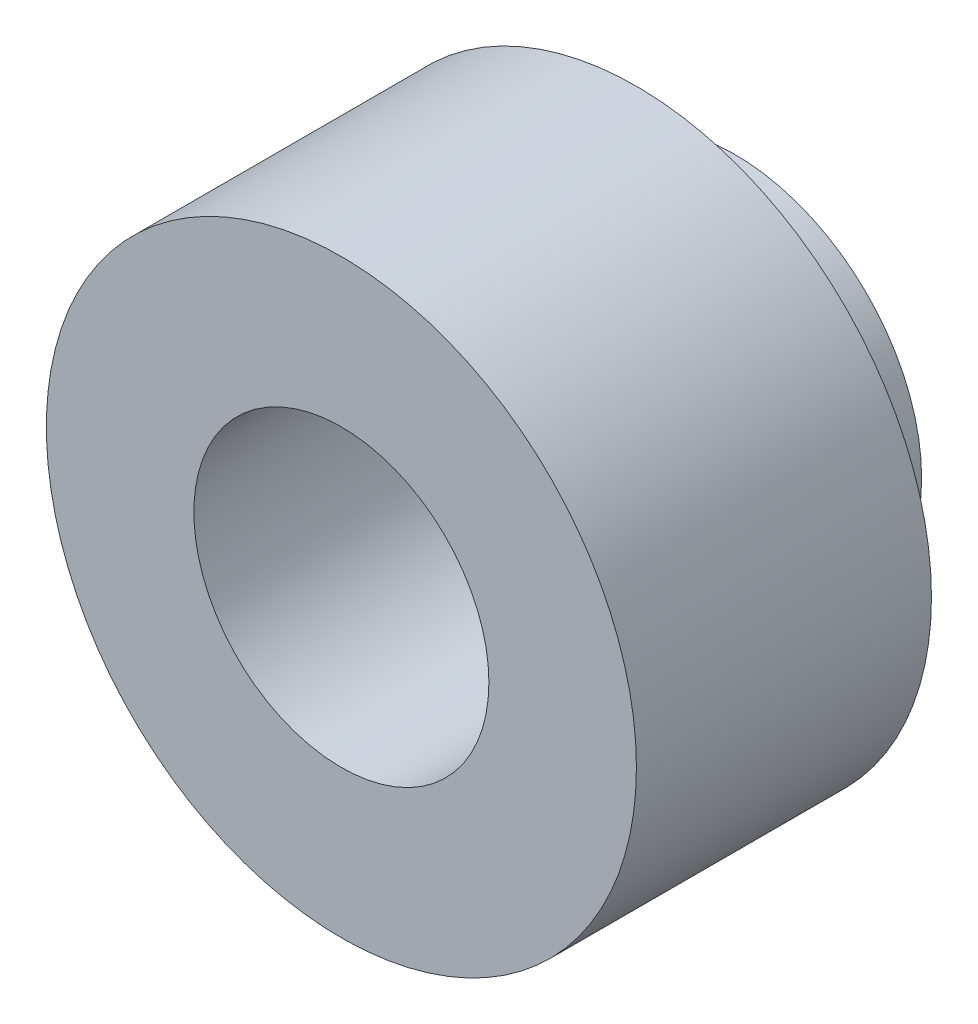
ISO-10303-21;
HEADER;
FILE_DESCRIPTION(('STEP AP214'),'2;1');
FILE_NAME('part.step','',(''),(''),'','','');
FILE_SCHEMA(('AUTOMOTIVE_DESIGN { 1 0 10303 214 1 1 1 1 }'));
ENDSEC;
DATA;
#1=APPLICATION_CONTEXT('core data for automotive mechanical design processes');
#2=APPLICATION_PROTOCOL_DEFINITION('international standard','automotive_design',2000,#1);
#3=PRODUCT_CONTEXT('',#1,'mechanical');
#4=PRODUCT('Part','Part','',(#3));
#5=PRODUCT_RELATED_PRODUCT_CATEGORY('part','',(#4));
#6=PRODUCT_DEFINITION_FORMATION('','',#4);
#7=PRODUCT_DEFINITION_CONTEXT('part definition',#1,'design');
#8=PRODUCT_DEFINITION('design','',#6,#7);
#9=PRODUCT_DEFINITION_SHAPE('','',#8);
#10=(LENGTH_UNIT() NAMED_UNIT(*) SI_UNIT(.MILLI.,.METRE.));
#11=(NAMED_UNIT(*) PLANE_ANGLE_UNIT() SI_UNIT($,.RADIAN.));
#12=(NAMED_UNIT(*) SI_UNIT($,.STERADIAN.) SOLID_ANGLE_UNIT());
#13=UNCERTAINTY_MEASURE_WITH_UNIT(LENGTH_MEASURE(1.E-05),#10,'distance_accuracy_value','');
#14=(GEOMETRIC_REPRESENTATION_CONTEXT(3) GLOBAL_UNCERTAINTY_ASSIGNED_CONTEXT((#13)) GLOBAL_UNIT_ASSIGNED_CONTEXT((#10,
#11,#12)) REPRESENTATION_CONTEXT('',''));
#15=CARTESIAN_POINT('',(0.,0.,0.));
#16=DIRECTION('',(0.,0.,1.));
#17=DIRECTION('',(1.,0.,0.));
#18=AXIS2_PLACEMENT_3D('',#15,#16,#17);
#19=CARTESIAN_POINT('',(0.,0.,0.));
#20=DIRECTION('',(0.,0.,1.));
#21=DIRECTION('',(1.,0.,0.));
#22=AXIS2_PLACEMENT_3D('',#19,#20,#21);
#23=CYLINDRICAL_SURFACE('',#22,1.875);
#24=CARTESIAN_POINT('',(0.,0.,0.));
#25=DIRECTION('',(0.,0.,1.));
#26=DIRECTION('',(1.,0.,0.));
#27=AXIS2_PLACEMENT_3D('',#24,#25,#26);
#28=CIRCLE('',#27,1.875);
#29=CARTESIAN_POINT('',(1.875,0.,0.));
#30=VERTEX_POINT('',#29);
#31=EDGE_CURVE('E53',#30,#30,#28,.T.);
#32=ORIENTED_EDGE('',*,*,#31,.T.);
#33=EDGE_LOOP('',(#32));
#34=FACE_BOUND('',#33,.T.);
#35=CARTESIAN_POINT('',(0.,0.,-5.));
#36=DIRECTION('',(0.,0.,1.));
#37=DIRECTION('',(1.,0.,0.));
#38=AXIS2_PLACEMENT_3D('',#35,#36,#37);
#39=CIRCLE('',#38,1.875);
#40=CARTESIAN_POINT('',(1.875,0.,-5.));
#41=VERTEX_POINT('',#40);
#42=EDGE_CURVE('E10',#41,#41,#39,.T.);
#43=ORIENTED_EDGE('',*,*,#42,.F.);
#44=EDGE_LOOP('',(#43));
#45=FACE_BOUND('',#44,.T.);
#46=ADVANCED_FACE('F31',(#34,#45),#23,.F.);
#47=CARTESIAN_POINT('',(1.875,0.,-5.));
#48=DIRECTION('',(0.,0.,-1.));
#49=DIRECTION('',(-1.,0.,0.));
#50=AXIS2_PLACEMENT_3D('',#47,#48,#49);
#51=PLANE('',#50);
#52=ORIENTED_EDGE('',*,*,#42,.T.);
#53=EDGE_LOOP('',(#52));
#54=FACE_BOUND('',#53,.T.);
#55=CARTESIAN_POINT('',(0.,0.,-5.));
#56=DIRECTION('',(0.,0.,1.));
#57=DIRECTION('',(1.,0.,0.));
#58=AXIS2_PLACEMENT_3D('',#55,#56,#57);
#59=CIRCLE('',#58,2.375);
#60=CARTESIAN_POINT('',(2.375,0.,-5.));
#61=VERTEX_POINT('',#60);
#62=EDGE_CURVE('E37',#61,#61,#59,.T.);
#63=ORIENTED_EDGE('',*,*,#62,.F.);
#64=EDGE_LOOP('',(#63));
#65=FACE_BOUND('',#64,.T.);
#66=ADVANCED_FACE('F71',(#54,#65),#51,.T.);
#67=CARTESIAN_POINT('',(0.,0.,0.));
#68=DIRECTION('',(0.,0.,1.));
#69=DIRECTION('',(1.,0.,0.));
#70=AXIS2_PLACEMENT_3D('',#67,#68,#69);
#71=CYLINDRICAL_SURFACE('',#70,2.375);
#72=ORIENTED_EDGE('',*,*,#62,.T.);
#73=EDGE_LOOP('',(#72));
#74=FACE_BOUND('',#73,.T.);
#75=CARTESIAN_POINT('',(0.,0.,-3.75));
#76=DIRECTION('',(0.,0.,1.));
#77=DIRECTION('',(1.,0.,0.));
#78=AXIS2_PLACEMENT_3D('',#75,#76,#77);
#79=CIRCLE('',#78,2.375);
#80=CARTESIAN_POINT('',(2.375,0.,-3.75));
#81=VERTEX_POINT('',#80);
#82=EDGE_CURVE('E41',#81,#81,#79,.T.);
#83=ORIENTED_EDGE('',*,*,#82,.F.);
#84=EDGE_LOOP('',(#83));
#85=FACE_BOUND('',#84,.T.);
#86=ADVANCED_FACE('F75',(#74,#85),#71,.T.);
#87=CARTESIAN_POINT('',(2.375,0.,-3.75));
#88=DIRECTION('',(0.,0.,-1.));
#89=DIRECTION('',(-1.,0.,0.));
#90=AXIS2_PLACEMENT_3D('',#87,#88,#89);
#91=PLANE('',#90);
#92=ORIENTED_EDGE('',*,*,#82,.T.);
#93=EDGE_LOOP('',(#92));
#94=FACE_BOUND('',#93,.T.);
#95=CARTESIAN_POINT('',(0.,0.,-3.75));
#96=DIRECTION('',(0.,0.,1.));
#97=DIRECTION('',(1.,0.,0.));
#98=AXIS2_PLACEMENT_3D('',#95,#96,#97);
#99=CIRCLE('',#98,3.75);
#100=CARTESIAN_POINT('',(3.75,0.,-3.75));
#101=VERTEX_POINT('',#100);
#102=EDGE_CURVE('E45',#101,#101,#99,.T.);
#103=ORIENTED_EDGE('',*,*,#102,.F.);
#104=EDGE_LOOP('',(#103));
#105=FACE_BOUND('',#104,.T.);
#106=ADVANCED_FACE('F67',(#94,#105),#91,.T.);
#107=CARTESIAN_POINT('',(0.,0.,0.));
#108=DIRECTION('',(0.,0.,1.));
#109=DIRECTION('',(1.,0.,0.));
#110=AXIS2_PLACEMENT_3D('',#107,#108,#109);
#111=CYLINDRICAL_SURFACE('',#110,3.75);
#112=ORIENTED_EDGE('',*,*,#102,.T.);
#113=EDGE_LOOP('',(#112));
#114=FACE_BOUND('',#113,.T.);
#115=CARTESIAN_POINT('',(0.,0.,0.));
#116=DIRECTION('',(0.,0.,1.));
#117=DIRECTION('',(1.,0.,0.));
#118=AXIS2_PLACEMENT_3D('',#115,#116,#117);
#119=CIRCLE('',#118,3.75);
#120=CARTESIAN_POINT('',(3.75,0.,0.));
#121=VERTEX_POINT('',#120);
#122=EDGE_CURVE('E50',#121,#121,#119,.T.);
#123=ORIENTED_EDGE('',*,*,#122,.F.);
#124=EDGE_LOOP('',(#123));
#125=FACE_BOUND('',#124,.T.);
#126=ADVANCED_FACE('F61',(#114,#125),#111,.T.);
#127=CARTESIAN_POINT('',(1.875,0.,0.));
#128=DIRECTION('',(0.,0.,1.));
#129=DIRECTION('',(1.,0.,0.));
#130=AXIS2_PLACEMENT_3D('',#127,#128,#129);
#131=PLANE('',#130);
#132=ORIENTED_EDGE('',*,*,#122,.T.);
#133=EDGE_LOOP('',(#132));
#134=FACE_BOUND('',#133,.T.);
#135=ORIENTED_EDGE('',*,*,#31,.F.);
#136=EDGE_LOOP('',(#135));
#137=FACE_BOUND('',#136,.T.);
#138=ADVANCED_FACE('F59',(#134,#137),#131,.T.);
#139=CLOSED_SHELL('',(#46,#66,#86,#106,#126,#138));
#140=MANIFOLD_SOLID_BREP('B2',#139);
#141=ADVANCED_BREP_SHAPE_REPRESENTATION('',(#18,#140),#14);
#142=SHAPE_DEFINITION_REPRESENTATION(#9,#141);
ENDSEC;
END-ISO-10303-21;
